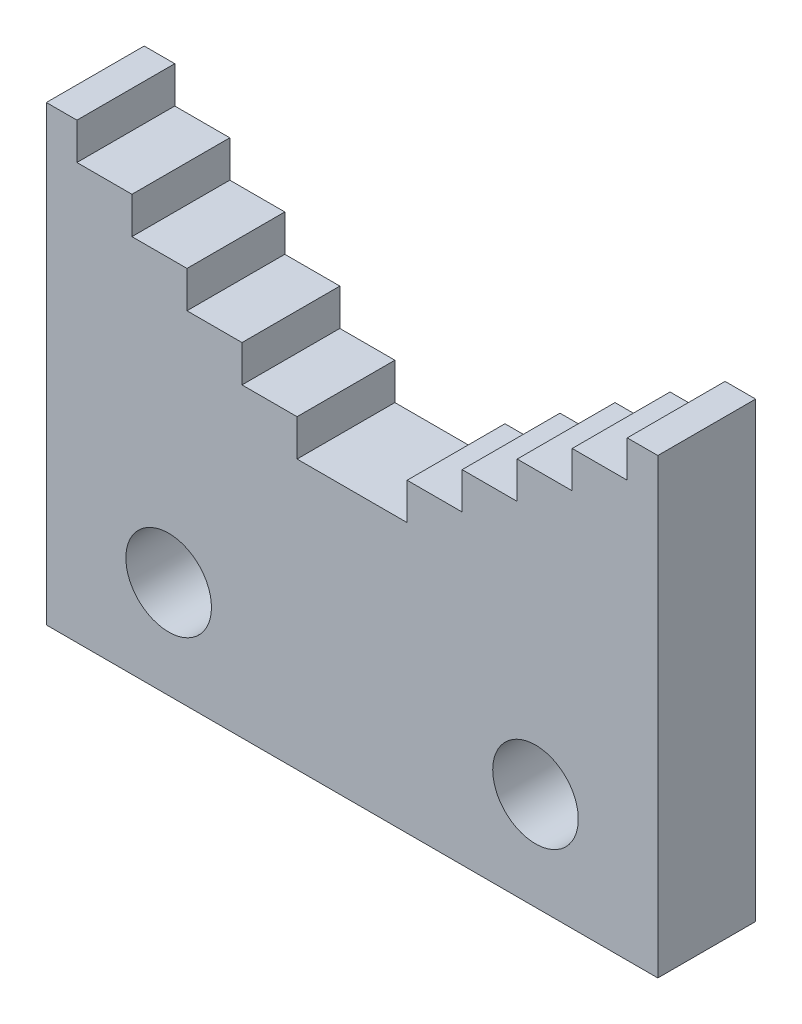
ISO-10303-21;
HEADER;
FILE_DESCRIPTION(('STEP AP214'),'2;1');
FILE_NAME('part.step','',(''),(''),'','','');
FILE_SCHEMA(('AUTOMOTIVE_DESIGN { 1 0 10303 214 1 1 1 1 }'));
ENDSEC;
DATA;
#1=APPLICATION_CONTEXT('core data for automotive mechanical design processes');
#2=APPLICATION_PROTOCOL_DEFINITION('international standard','automotive_design',2000,#1);
#3=PRODUCT_CONTEXT('',#1,'mechanical');
#4=PRODUCT('Part','Part','',(#3));
#5=PRODUCT_RELATED_PRODUCT_CATEGORY('part','',(#4));
#6=PRODUCT_DEFINITION_FORMATION('','',#4);
#7=PRODUCT_DEFINITION_CONTEXT('part definition',#1,'design');
#8=PRODUCT_DEFINITION('design','',#6,#7);
#9=PRODUCT_DEFINITION_SHAPE('','',#8);
#10=(LENGTH_UNIT() NAMED_UNIT(*) SI_UNIT(.MILLI.,.METRE.));
#11=(NAMED_UNIT(*) PLANE_ANGLE_UNIT() SI_UNIT($,.RADIAN.));
#12=(NAMED_UNIT(*) SI_UNIT($,.STERADIAN.) SOLID_ANGLE_UNIT());
#13=UNCERTAINTY_MEASURE_WITH_UNIT(LENGTH_MEASURE(1.E-05),#10,'distance_accuracy_value','');
#14=(GEOMETRIC_REPRESENTATION_CONTEXT(3) GLOBAL_UNCERTAINTY_ASSIGNED_CONTEXT((#13)) GLOBAL_UNIT_ASSIGNED_CONTEXT((#10,
#11,#12)) REPRESENTATION_CONTEXT('',''));
#15=CARTESIAN_POINT('',(0.,0.,0.));
#16=DIRECTION('',(0.,0.,1.));
#17=DIRECTION('',(1.,0.,0.));
#18=AXIS2_PLACEMENT_3D('',#15,#16,#17);
#19=CARTESIAN_POINT('',(0.,0.,8.));
#20=DIRECTION('',(0.,0.,-1.));
#21=DIRECTION('',(-1.,0.,0.));
#22=AXIS2_PLACEMENT_3D('',#19,#20,#21);
#23=PLANE('',#22);
#24=DIRECTION('',(0.,-1.,0.));
#25=VECTOR('',#24,1.);
#26=CARTESIAN_POINT('',(-25.,0.,8.));
#27=LINE('',#26,#25);
#28=CARTESIAN_POINT('',(-25.,37.,8.));
#29=VERTEX_POINT('',#28);
#30=CARTESIAN_POINT('',(-25.,0.,8.));
#31=VERTEX_POINT('',#30);
#32=EDGE_CURVE('E311',#29,#31,#27,.T.);
#33=ORIENTED_EDGE('',*,*,#32,.T.);
#34=DIRECTION('',(1.,0.,0.));
#35=VECTOR('',#34,1.);
#36=CARTESIAN_POINT('',(25.,0.,8.));
#37=LINE('',#36,#35);
#38=CARTESIAN_POINT('',(25.,0.,8.));
#39=VERTEX_POINT('',#38);
#40=EDGE_CURVE('E151',#31,#39,#37,.T.);
#41=ORIENTED_EDGE('',*,*,#40,.T.);
#42=DIRECTION('',(0.,1.,0.));
#43=VECTOR('',#42,1.);
#44=CARTESIAN_POINT('',(25.,0.,8.));
#45=LINE('',#44,#43);
#46=CARTESIAN_POINT('',(25.0000000000001,37.,8.));
#47=VERTEX_POINT('',#46);
#48=EDGE_CURVE('E396',#39,#47,#45,.T.);
#49=ORIENTED_EDGE('',*,*,#48,.T.);
#50=DIRECTION('',(-1.,0.,0.));
#51=VECTOR('',#50,1.);
#52=CARTESIAN_POINT('',(25.0000000000001,37.,8.));
#53=LINE('',#52,#51);
#54=CARTESIAN_POINT('',(22.5000000000001,37.,8.));
#55=VERTEX_POINT('',#54);
#56=EDGE_CURVE('E416',#47,#55,#53,.T.);
#57=ORIENTED_EDGE('',*,*,#56,.T.);
#58=DIRECTION('',(0.,-1.,0.));
#59=VECTOR('',#58,1.);
#60=CARTESIAN_POINT('',(22.5000000000001,37.,8.));
#61=LINE('',#60,#59);
#62=CARTESIAN_POINT('',(22.5,34.,8.));
#63=VERTEX_POINT('',#62);
#64=EDGE_CURVE('E412',#55,#63,#61,.T.);
#65=ORIENTED_EDGE('',*,*,#64,.T.);
#66=DIRECTION('',(-1.,0.,0.));
#67=VECTOR('',#66,1.);
#68=CARTESIAN_POINT('',(22.5,34.,8.));
#69=LINE('',#68,#67);
#70=CARTESIAN_POINT('',(18.,34.,8.));
#71=VERTEX_POINT('',#70);
#72=EDGE_CURVE('E415',#63,#71,#69,.T.);
#73=ORIENTED_EDGE('',*,*,#72,.T.);
#74=DIRECTION('',(0.,-1.,0.));
#75=VECTOR('',#74,1.);
#76=CARTESIAN_POINT('',(18.,34.,8.));
#77=LINE('',#76,#75);
#78=CARTESIAN_POINT('',(18.,31.,8.));
#79=VERTEX_POINT('',#78);
#80=EDGE_CURVE('E420',#71,#79,#77,.T.);
#81=ORIENTED_EDGE('',*,*,#80,.T.);
#82=DIRECTION('',(-1.,0.,0.));
#83=VECTOR('',#82,1.);
#84=CARTESIAN_POINT('',(18.,31.,8.));
#85=LINE('',#84,#83);
#86=CARTESIAN_POINT('',(13.5,31.,8.));
#87=VERTEX_POINT('',#86);
#88=EDGE_CURVE('E427',#79,#87,#85,.T.);
#89=ORIENTED_EDGE('',*,*,#88,.T.);
#90=DIRECTION('',(0.,-1.,0.));
#91=VECTOR('',#90,1.);
#92=CARTESIAN_POINT('',(13.5,31.,8.));
#93=LINE('',#92,#91);
#94=CARTESIAN_POINT('',(13.5,28.,8.));
#95=VERTEX_POINT('',#94);
#96=EDGE_CURVE('E430',#87,#95,#93,.T.);
#97=ORIENTED_EDGE('',*,*,#96,.T.);
#98=DIRECTION('',(-1.,0.,0.));
#99=VECTOR('',#98,1.);
#100=CARTESIAN_POINT('',(13.5,28.,8.));
#101=LINE('',#100,#99);
#102=CARTESIAN_POINT('',(9.00000000000004,28.,8.));
#103=VERTEX_POINT('',#102);
#104=EDGE_CURVE('E433',#95,#103,#101,.T.);
#105=ORIENTED_EDGE('',*,*,#104,.T.);
#106=DIRECTION('',(0.,-1.,0.));
#107=VECTOR('',#106,1.);
#108=CARTESIAN_POINT('',(9.00000000000004,28.,8.));
#109=LINE('',#108,#107);
#110=CARTESIAN_POINT('',(9.00000000000004,25.,8.));
#111=VERTEX_POINT('',#110);
#112=EDGE_CURVE('E436',#103,#111,#109,.T.);
#113=ORIENTED_EDGE('',*,*,#112,.T.);
#114=DIRECTION('',(-1.,0.,0.));
#115=VECTOR('',#114,1.);
#116=CARTESIAN_POINT('',(9.00000000000004,25.,8.));
#117=LINE('',#116,#115);
#118=CARTESIAN_POINT('',(4.50000000000004,25.,8.));
#119=VERTEX_POINT('',#118);
#120=EDGE_CURVE('E439',#111,#119,#117,.T.);
#121=ORIENTED_EDGE('',*,*,#120,.T.);
#122=DIRECTION('',(0.,-1.,0.));
#123=VECTOR('',#122,1.);
#124=CARTESIAN_POINT('',(4.50000000000004,25.,8.));
#125=LINE('',#124,#123);
#126=CARTESIAN_POINT('',(4.50000000000003,22.,8.));
#127=VERTEX_POINT('',#126);
#128=EDGE_CURVE('E442',#119,#127,#125,.T.);
#129=ORIENTED_EDGE('',*,*,#128,.T.);
#130=DIRECTION('',(-1.,0.,0.));
#131=VECTOR('',#130,1.);
#132=CARTESIAN_POINT('',(-4.50000000000001,22.,8.));
#133=LINE('',#132,#131);
#134=CARTESIAN_POINT('',(-4.50000000000001,22.,8.));
#135=VERTEX_POINT('',#134);
#136=EDGE_CURVE('E445',#127,#135,#133,.T.);
#137=ORIENTED_EDGE('',*,*,#136,.T.);
#138=DIRECTION('',(0.,1.,0.));
#139=VECTOR('',#138,1.);
#140=CARTESIAN_POINT('',(-4.50000000000001,25.,8.));
#141=LINE('',#140,#139);
#142=CARTESIAN_POINT('',(-4.50000000000001,25.,8.));
#143=VERTEX_POINT('',#142);
#144=EDGE_CURVE('E448',#135,#143,#141,.T.);
#145=ORIENTED_EDGE('',*,*,#144,.T.);
#146=DIRECTION('',(-1.,0.,0.));
#147=VECTOR('',#146,1.);
#148=CARTESIAN_POINT('',(-9.00000000000001,25.,8.));
#149=LINE('',#148,#147);
#150=CARTESIAN_POINT('',(-9.00000000000001,25.,8.));
#151=VERTEX_POINT('',#150);
#152=EDGE_CURVE('E451',#143,#151,#149,.T.);
#153=ORIENTED_EDGE('',*,*,#152,.T.);
#154=DIRECTION('',(0.,1.,0.));
#155=VECTOR('',#154,1.);
#156=CARTESIAN_POINT('',(-9.00000000000001,28.,8.));
#157=LINE('',#156,#155);
#158=CARTESIAN_POINT('',(-9.00000000000001,28.,8.));
#159=VERTEX_POINT('',#158);
#160=EDGE_CURVE('E454',#151,#159,#157,.T.);
#161=ORIENTED_EDGE('',*,*,#160,.T.);
#162=DIRECTION('',(-1.,0.,0.));
#163=VECTOR('',#162,1.);
#164=CARTESIAN_POINT('',(-13.5,28.,8.));
#165=LINE('',#164,#163);
#166=CARTESIAN_POINT('',(-13.5,28.,8.));
#167=VERTEX_POINT('',#166);
#168=EDGE_CURVE('E457',#159,#167,#165,.T.);
#169=ORIENTED_EDGE('',*,*,#168,.T.);
#170=DIRECTION('',(0.,1.,0.));
#171=VECTOR('',#170,1.);
#172=CARTESIAN_POINT('',(-13.5,31.,8.));
#173=LINE('',#172,#171);
#174=CARTESIAN_POINT('',(-13.5,31.,8.));
#175=VERTEX_POINT('',#174);
#176=EDGE_CURVE('E460',#167,#175,#173,.T.);
#177=ORIENTED_EDGE('',*,*,#176,.T.);
#178=DIRECTION('',(-1.,0.,0.));
#179=VECTOR('',#178,1.);
#180=CARTESIAN_POINT('',(-18.,31.,8.));
#181=LINE('',#180,#179);
#182=CARTESIAN_POINT('',(-18.,31.,8.));
#183=VERTEX_POINT('',#182);
#184=EDGE_CURVE('E463',#175,#183,#181,.T.);
#185=ORIENTED_EDGE('',*,*,#184,.T.);
#186=DIRECTION('',(0.,1.,0.));
#187=VECTOR('',#186,1.);
#188=CARTESIAN_POINT('',(-18.,34.,8.));
#189=LINE('',#188,#187);
#190=CARTESIAN_POINT('',(-18.,34.,8.));
#191=VERTEX_POINT('',#190);
#192=EDGE_CURVE('E218',#183,#191,#189,.T.);
#193=ORIENTED_EDGE('',*,*,#192,.T.);
#194=DIRECTION('',(-1.,0.,0.));
#195=VECTOR('',#194,1.);
#196=CARTESIAN_POINT('',(-22.5,34.,8.));
#197=LINE('',#196,#195);
#198=CARTESIAN_POINT('',(-22.5,34.,8.));
#199=VERTEX_POINT('',#198);
#200=EDGE_CURVE('E212',#191,#199,#197,.T.);
#201=ORIENTED_EDGE('',*,*,#200,.T.);
#202=DIRECTION('',(0.,1.,0.));
#203=VECTOR('',#202,1.);
#204=CARTESIAN_POINT('',(-22.5,37.,8.));
#205=LINE('',#204,#203);
#206=CARTESIAN_POINT('',(-22.5,37.,8.));
#207=VERTEX_POINT('',#206);
#208=EDGE_CURVE('E216',#199,#207,#205,.T.);
#209=ORIENTED_EDGE('',*,*,#208,.T.);
#210=DIRECTION('',(-1.,0.,0.));
#211=VECTOR('',#210,1.);
#212=CARTESIAN_POINT('',(-25.,37.,8.));
#213=LINE('',#212,#211);
#214=EDGE_CURVE('E60',#207,#29,#213,.T.);
#215=ORIENTED_EDGE('',*,*,#214,.T.);
#216=EDGE_LOOP('',(#33,#41,#49,#57,#65,#73,#81,#89,#97,#105,#113,#121,#129,#137,#145,#153,#161,
#169,#177,#185,#193,#201,#209,#215));
#217=FACE_BOUND('',#216,.T.);
#218=CARTESIAN_POINT('',(-15.,8.,8.));
#219=DIRECTION('',(0.,0.,1.));
#220=DIRECTION('',(1.,0.,0.));
#221=AXIS2_PLACEMENT_3D('',#218,#219,#220);
#222=CIRCLE('',#221,3.5);
#223=CARTESIAN_POINT('',(-11.5,8.,8.));
#224=VERTEX_POINT('',#223);
#225=EDGE_CURVE('E245',#224,#224,#222,.T.);
#226=ORIENTED_EDGE('',*,*,#225,.F.);
#227=EDGE_LOOP('',(#226));
#228=FACE_BOUND('',#227,.T.);
#229=CARTESIAN_POINT('',(15.,7.99999999999998,8.));
#230=DIRECTION('',(0.,0.,1.));
#231=DIRECTION('',(-1.,0.,0.));
#232=AXIS2_PLACEMENT_3D('',#229,#230,#231);
#233=CIRCLE('',#232,3.5);
#234=CARTESIAN_POINT('',(11.5,7.99999999999998,8.));
#235=VERTEX_POINT('',#234);
#236=EDGE_CURVE('E506',#235,#235,#233,.T.);
#237=ORIENTED_EDGE('',*,*,#236,.F.);
#238=EDGE_LOOP('',(#237));
#239=FACE_BOUND('',#238,.T.);
#240=ADVANCED_FACE('F42',(#217,#228,#239),#23,.F.);
#241=CARTESIAN_POINT('',(0.,0.,0.));
#242=DIRECTION('',(0.,0.,-1.));
#243=DIRECTION('',(-1.,0.,0.));
#244=AXIS2_PLACEMENT_3D('',#241,#242,#243);
#245=PLANE('',#244);
#246=CARTESIAN_POINT('',(-15.,8.,0.));
#247=DIRECTION('',(0.,0.,1.));
#248=DIRECTION('',(1.,0.,0.));
#249=AXIS2_PLACEMENT_3D('',#246,#247,#248);
#250=CIRCLE('',#249,3.5);
#251=CARTESIAN_POINT('',(-11.5,8.,0.));
#252=VERTEX_POINT('',#251);
#253=EDGE_CURVE('E513',#252,#252,#250,.T.);
#254=ORIENTED_EDGE('',*,*,#253,.T.);
#255=EDGE_LOOP('',(#254));
#256=FACE_BOUND('',#255,.T.);
#257=DIRECTION('',(0.,-1.,0.));
#258=VECTOR('',#257,1.);
#259=CARTESIAN_POINT('',(-25.,0.,0.));
#260=LINE('',#259,#258);
#261=CARTESIAN_POINT('',(-25.,37.,0.));
#262=VERTEX_POINT('',#261);
#263=CARTESIAN_POINT('',(-25.,0.,0.));
#264=VERTEX_POINT('',#263);
#265=EDGE_CURVE('E240',#262,#264,#260,.T.);
#266=ORIENTED_EDGE('',*,*,#265,.F.);
#267=DIRECTION('',(-1.,0.,0.));
#268=VECTOR('',#267,1.);
#269=CARTESIAN_POINT('',(-25.,37.,0.));
#270=LINE('',#269,#268);
#271=CARTESIAN_POINT('',(-22.5,37.,0.));
#272=VERTEX_POINT('',#271);
#273=EDGE_CURVE('E143',#272,#262,#270,.T.);
#274=ORIENTED_EDGE('',*,*,#273,.F.);
#275=DIRECTION('',(0.,1.,0.));
#276=VECTOR('',#275,1.);
#277=CARTESIAN_POINT('',(-22.5,37.,0.));
#278=LINE('',#277,#276);
#279=CARTESIAN_POINT('',(-22.5,34.,0.));
#280=VERTEX_POINT('',#279);
#281=EDGE_CURVE('E137',#280,#272,#278,.T.);
#282=ORIENTED_EDGE('',*,*,#281,.F.);
#283=DIRECTION('',(-1.,0.,0.));
#284=VECTOR('',#283,1.);
#285=CARTESIAN_POINT('',(-22.5,34.,0.));
#286=LINE('',#285,#284);
#287=CARTESIAN_POINT('',(-18.,34.,0.));
#288=VERTEX_POINT('',#287);
#289=EDGE_CURVE('E227',#288,#280,#286,.T.);
#290=ORIENTED_EDGE('',*,*,#289,.F.);
#291=DIRECTION('',(0.,1.,0.));
#292=VECTOR('',#291,1.);
#293=CARTESIAN_POINT('',(-18.,34.,0.));
#294=LINE('',#293,#292);
#295=CARTESIAN_POINT('',(-18.,31.,0.));
#296=VERTEX_POINT('',#295);
#297=EDGE_CURVE('E302',#296,#288,#294,.T.);
#298=ORIENTED_EDGE('',*,*,#297,.F.);
#299=DIRECTION('',(-1.,0.,0.));
#300=VECTOR('',#299,1.);
#301=CARTESIAN_POINT('',(-18.,31.,0.));
#302=LINE('',#301,#300);
#303=CARTESIAN_POINT('',(-13.5,31.,0.));
#304=VERTEX_POINT('',#303);
#305=EDGE_CURVE('E299',#304,#296,#302,.T.);
#306=ORIENTED_EDGE('',*,*,#305,.F.);
#307=DIRECTION('',(0.,1.,0.));
#308=VECTOR('',#307,1.);
#309=CARTESIAN_POINT('',(-13.5,31.,0.));
#310=LINE('',#309,#308);
#311=CARTESIAN_POINT('',(-13.5,28.,0.));
#312=VERTEX_POINT('',#311);
#313=EDGE_CURVE('E296',#312,#304,#310,.T.);
#314=ORIENTED_EDGE('',*,*,#313,.F.);
#315=DIRECTION('',(-1.,0.,0.));
#316=VECTOR('',#315,1.);
#317=CARTESIAN_POINT('',(-13.5,28.,0.));
#318=LINE('',#317,#316);
#319=CARTESIAN_POINT('',(-9.00000000000001,28.,0.));
#320=VERTEX_POINT('',#319);
#321=EDGE_CURVE('E293',#320,#312,#318,.T.);
#322=ORIENTED_EDGE('',*,*,#321,.F.);
#323=DIRECTION('',(0.,1.,0.));
#324=VECTOR('',#323,1.);
#325=CARTESIAN_POINT('',(-9.00000000000001,28.,0.));
#326=LINE('',#325,#324);
#327=CARTESIAN_POINT('',(-9.00000000000001,25.,0.));
#328=VERTEX_POINT('',#327);
#329=EDGE_CURVE('E290',#328,#320,#326,.T.);
#330=ORIENTED_EDGE('',*,*,#329,.F.);
#331=DIRECTION('',(-1.,0.,0.));
#332=VECTOR('',#331,1.);
#333=CARTESIAN_POINT('',(-9.00000000000001,25.,0.));
#334=LINE('',#333,#332);
#335=CARTESIAN_POINT('',(-4.50000000000001,25.,0.));
#336=VERTEX_POINT('',#335);
#337=EDGE_CURVE('E287',#336,#328,#334,.T.);
#338=ORIENTED_EDGE('',*,*,#337,.F.);
#339=DIRECTION('',(0.,1.,0.));
#340=VECTOR('',#339,1.);
#341=CARTESIAN_POINT('',(-4.50000000000001,25.,0.));
#342=LINE('',#341,#340);
#343=CARTESIAN_POINT('',(-4.50000000000001,22.,0.));
#344=VERTEX_POINT('',#343);
#345=EDGE_CURVE('E284',#344,#336,#342,.T.);
#346=ORIENTED_EDGE('',*,*,#345,.F.);
#347=DIRECTION('',(-1.,0.,0.));
#348=VECTOR('',#347,1.);
#349=CARTESIAN_POINT('',(-4.50000000000001,22.,0.));
#350=LINE('',#349,#348);
#351=CARTESIAN_POINT('',(4.50000000000003,22.,0.));
#352=VERTEX_POINT('',#351);
#353=EDGE_CURVE('E281',#352,#344,#350,.T.);
#354=ORIENTED_EDGE('',*,*,#353,.F.);
#355=DIRECTION('',(0.,-1.,0.));
#356=VECTOR('',#355,1.);
#357=CARTESIAN_POINT('',(4.50000000000004,25.,0.));
#358=LINE('',#357,#356);
#359=CARTESIAN_POINT('',(4.50000000000004,25.,0.));
#360=VERTEX_POINT('',#359);
#361=EDGE_CURVE('E278',#360,#352,#358,.T.);
#362=ORIENTED_EDGE('',*,*,#361,.F.);
#363=DIRECTION('',(-1.,0.,0.));
#364=VECTOR('',#363,1.);
#365=CARTESIAN_POINT('',(9.00000000000004,25.,0.));
#366=LINE('',#365,#364);
#367=CARTESIAN_POINT('',(9.00000000000004,25.,0.));
#368=VERTEX_POINT('',#367);
#369=EDGE_CURVE('E275',#368,#360,#366,.T.);
#370=ORIENTED_EDGE('',*,*,#369,.F.);
#371=DIRECTION('',(0.,-1.,0.));
#372=VECTOR('',#371,1.);
#373=CARTESIAN_POINT('',(9.00000000000004,28.,0.));
#374=LINE('',#373,#372);
#375=CARTESIAN_POINT('',(9.00000000000004,28.,0.));
#376=VERTEX_POINT('',#375);
#377=EDGE_CURVE('E272',#376,#368,#374,.T.);
#378=ORIENTED_EDGE('',*,*,#377,.F.);
#379=DIRECTION('',(-1.,0.,0.));
#380=VECTOR('',#379,1.);
#381=CARTESIAN_POINT('',(13.5,28.,0.));
#382=LINE('',#381,#380);
#383=CARTESIAN_POINT('',(13.5,28.,0.));
#384=VERTEX_POINT('',#383);
#385=EDGE_CURVE('E269',#384,#376,#382,.T.);
#386=ORIENTED_EDGE('',*,*,#385,.F.);
#387=DIRECTION('',(0.,-1.,0.));
#388=VECTOR('',#387,1.);
#389=CARTESIAN_POINT('',(13.5,31.,0.));
#390=LINE('',#389,#388);
#391=CARTESIAN_POINT('',(13.5,31.,0.));
#392=VERTEX_POINT('',#391);
#393=EDGE_CURVE('E266',#392,#384,#390,.T.);
#394=ORIENTED_EDGE('',*,*,#393,.F.);
#395=DIRECTION('',(-1.,0.,0.));
#396=VECTOR('',#395,1.);
#397=CARTESIAN_POINT('',(18.,31.,0.));
#398=LINE('',#397,#396);
#399=CARTESIAN_POINT('',(18.,31.,0.));
#400=VERTEX_POINT('',#399);
#401=EDGE_CURVE('E263',#400,#392,#398,.T.);
#402=ORIENTED_EDGE('',*,*,#401,.F.);
#403=DIRECTION('',(0.,-1.,0.));
#404=VECTOR('',#403,1.);
#405=CARTESIAN_POINT('',(18.,34.,0.));
#406=LINE('',#405,#404);
#407=CARTESIAN_POINT('',(18.,34.,0.));
#408=VERTEX_POINT('',#407);
#409=EDGE_CURVE('E260',#408,#400,#406,.T.);
#410=ORIENTED_EDGE('',*,*,#409,.F.);
#411=DIRECTION('',(-1.,0.,0.));
#412=VECTOR('',#411,1.);
#413=CARTESIAN_POINT('',(22.5,34.,0.));
#414=LINE('',#413,#412);
#415=CARTESIAN_POINT('',(22.5,34.,0.));
#416=VERTEX_POINT('',#415);
#417=EDGE_CURVE('E257',#416,#408,#414,.T.);
#418=ORIENTED_EDGE('',*,*,#417,.F.);
#419=DIRECTION('',(0.,-1.,0.));
#420=VECTOR('',#419,1.);
#421=CARTESIAN_POINT('',(22.5000000000001,37.,0.));
#422=LINE('',#421,#420);
#423=CARTESIAN_POINT('',(22.5000000000001,37.,0.));
#424=VERTEX_POINT('',#423);
#425=EDGE_CURVE('E254',#424,#416,#422,.T.);
#426=ORIENTED_EDGE('',*,*,#425,.F.);
#427=DIRECTION('',(-1.,0.,0.));
#428=VECTOR('',#427,1.);
#429=CARTESIAN_POINT('',(25.0000000000001,37.,0.));
#430=LINE('',#429,#428);
#431=CARTESIAN_POINT('',(25.0000000000001,37.,0.));
#432=VERTEX_POINT('',#431);
#433=EDGE_CURVE('E251',#432,#424,#430,.T.);
#434=ORIENTED_EDGE('',*,*,#433,.F.);
#435=DIRECTION('',(0.,1.,0.));
#436=VECTOR('',#435,1.);
#437=CARTESIAN_POINT('',(25.,0.,0.));
#438=LINE('',#437,#436);
#439=CARTESIAN_POINT('',(25.,0.,0.));
#440=VERTEX_POINT('',#439);
#441=EDGE_CURVE('E248',#440,#432,#438,.T.);
#442=ORIENTED_EDGE('',*,*,#441,.F.);
#443=DIRECTION('',(1.,0.,0.));
#444=VECTOR('',#443,1.);
#445=CARTESIAN_POINT('',(25.,0.,0.));
#446=LINE('',#445,#444);
#447=EDGE_CURVE('E244',#264,#440,#446,.T.);
#448=ORIENTED_EDGE('',*,*,#447,.F.);
#449=EDGE_LOOP('',(#266,#274,#282,#290,#298,#306,#314,#322,#330,#338,#346,#354,#362,#370,#378,
#386,#394,#402,#410,#418,#426,#434,#442,#448));
#450=FACE_BOUND('',#449,.T.);
#451=CARTESIAN_POINT('',(15.,7.99999999999998,0.));
#452=DIRECTION('',(0.,0.,1.));
#453=DIRECTION('',(-1.,0.,0.));
#454=AXIS2_PLACEMENT_3D('',#451,#452,#453);
#455=CIRCLE('',#454,3.5);
#456=CARTESIAN_POINT('',(11.5,7.99999999999998,0.));
#457=VERTEX_POINT('',#456);
#458=EDGE_CURVE('E509',#457,#457,#455,.T.);
#459=ORIENTED_EDGE('',*,*,#458,.T.);
#460=EDGE_LOOP('',(#459));
#461=FACE_BOUND('',#460,.T.);
#462=ADVANCED_FACE('F400',(#256,#450,#461),#245,.T.);
#463=CARTESIAN_POINT('',(-25.,0.,8.));
#464=DIRECTION('',(1.,0.,0.));
#465=DIRECTION('',(0.,1.,0.));
#466=AXIS2_PLACEMENT_3D('',#463,#464,#465);
#467=PLANE('',#466);
#468=ORIENTED_EDGE('',*,*,#265,.T.);
#469=DIRECTION('',(0.,0.,-1.));
#470=VECTOR('',#469,1.);
#471=CARTESIAN_POINT('',(-25.,0.,8.));
#472=LINE('',#471,#470);
#473=EDGE_CURVE('E11',#31,#264,#472,.T.);
#474=ORIENTED_EDGE('',*,*,#473,.F.);
#475=ORIENTED_EDGE('',*,*,#32,.F.);
#476=DIRECTION('',(0.,0.,-1.));
#477=VECTOR('',#476,1.);
#478=CARTESIAN_POINT('',(-25.,37.,8.));
#479=LINE('',#478,#477);
#480=EDGE_CURVE('E236',#29,#262,#479,.T.);
#481=ORIENTED_EDGE('',*,*,#480,.T.);
#482=EDGE_LOOP('',(#468,#474,#475,#481));
#483=FACE_BOUND('',#482,.T.);
#484=ADVANCED_FACE('F44',(#483),#467,.F.);
#485=CARTESIAN_POINT('',(25.,0.,8.));
#486=DIRECTION('',(0.,1.,0.));
#487=DIRECTION('',(-1.,0.,0.));
#488=AXIS2_PLACEMENT_3D('',#485,#486,#487);
#489=PLANE('',#488);
#490=ORIENTED_EDGE('',*,*,#447,.T.);
#491=DIRECTION('',(0.,0.,-1.));
#492=VECTOR('',#491,1.);
#493=CARTESIAN_POINT('',(25.,0.,8.));
#494=LINE('',#493,#492);
#495=EDGE_CURVE('E52',#39,#440,#494,.T.);
#496=ORIENTED_EDGE('',*,*,#495,.F.);
#497=ORIENTED_EDGE('',*,*,#40,.F.);
#498=ORIENTED_EDGE('',*,*,#473,.T.);
#499=EDGE_LOOP('',(#490,#496,#497,#498));
#500=FACE_BOUND('',#499,.T.);
#501=ADVANCED_FACE('F755',(#500),#489,.F.);
#502=CARTESIAN_POINT('',(25.,0.,8.));
#503=DIRECTION('',(-1.,0.,0.));
#504=DIRECTION('',(0.,-1.,0.));
#505=AXIS2_PLACEMENT_3D('',#502,#503,#504);
#506=PLANE('',#505);
#507=ORIENTED_EDGE('',*,*,#441,.T.);
#508=DIRECTION('',(0.,0.,-1.));
#509=VECTOR('',#508,1.);
#510=CARTESIAN_POINT('',(25.0000000000001,37.,8.));
#511=LINE('',#510,#509);
#512=EDGE_CURVE('E386',#47,#432,#511,.T.);
#513=ORIENTED_EDGE('',*,*,#512,.F.);
#514=ORIENTED_EDGE('',*,*,#48,.F.);
#515=ORIENTED_EDGE('',*,*,#495,.T.);
#516=EDGE_LOOP('',(#507,#513,#514,#515));
#517=FACE_BOUND('',#516,.T.);
#518=ADVANCED_FACE('F394',(#517),#506,.F.);
#519=CARTESIAN_POINT('',(25.0000000000001,37.,8.));
#520=DIRECTION('',(0.,-1.,0.));
#521=DIRECTION('',(0.,0.,-1.));
#522=AXIS2_PLACEMENT_3D('',#519,#520,#521);
#523=PLANE('',#522);
#524=ORIENTED_EDGE('',*,*,#433,.T.);
#525=DIRECTION('',(0.,0.,-1.));
#526=VECTOR('',#525,1.);
#527=CARTESIAN_POINT('',(22.5000000000001,37.,8.));
#528=LINE('',#527,#526);
#529=EDGE_CURVE('E382',#55,#424,#528,.T.);
#530=ORIENTED_EDGE('',*,*,#529,.F.);
#531=ORIENTED_EDGE('',*,*,#56,.F.);
#532=ORIENTED_EDGE('',*,*,#512,.T.);
#533=EDGE_LOOP('',(#524,#530,#531,#532));
#534=FACE_BOUND('',#533,.T.);
#535=ADVANCED_FACE('F406',(#534),#523,.F.);
#536=CARTESIAN_POINT('',(22.5000000000001,37.,8.));
#537=DIRECTION('',(1.,0.,0.));
#538=DIRECTION('',(0.,1.,0.));
#539=AXIS2_PLACEMENT_3D('',#536,#537,#538);
#540=PLANE('',#539);
#541=ORIENTED_EDGE('',*,*,#425,.T.);
#542=DIRECTION('',(0.,0.,-1.));
#543=VECTOR('',#542,1.);
#544=CARTESIAN_POINT('',(22.5,34.,8.));
#545=LINE('',#544,#543);
#546=EDGE_CURVE('E378',#63,#416,#545,.T.);
#547=ORIENTED_EDGE('',*,*,#546,.F.);
#548=ORIENTED_EDGE('',*,*,#64,.F.);
#549=ORIENTED_EDGE('',*,*,#529,.T.);
#550=EDGE_LOOP('',(#541,#547,#548,#549));
#551=FACE_BOUND('',#550,.T.);
#552=ADVANCED_FACE('F410',(#551),#540,.F.);
#553=CARTESIAN_POINT('',(22.5,34.,8.));
#554=DIRECTION('',(0.,-1.,0.));
#555=DIRECTION('',(0.,0.,-1.));
#556=AXIS2_PLACEMENT_3D('',#553,#554,#555);
#557=PLANE('',#556);
#558=ORIENTED_EDGE('',*,*,#417,.T.);
#559=DIRECTION('',(0.,0.,-1.));
#560=VECTOR('',#559,1.);
#561=CARTESIAN_POINT('',(18.,34.,8.));
#562=LINE('',#561,#560);
#563=EDGE_CURVE('E374',#71,#408,#562,.T.);
#564=ORIENTED_EDGE('',*,*,#563,.F.);
#565=ORIENTED_EDGE('',*,*,#72,.F.);
#566=ORIENTED_EDGE('',*,*,#546,.T.);
#567=EDGE_LOOP('',(#558,#564,#565,#566));
#568=FACE_BOUND('',#567,.T.);
#569=ADVANCED_FACE('F716',(#568),#557,.F.);
#570=CARTESIAN_POINT('',(18.,34.,8.));
#571=DIRECTION('',(1.,0.,0.));
#572=DIRECTION('',(0.,0.,-1.));
#573=AXIS2_PLACEMENT_3D('',#570,#571,#572);
#574=PLANE('',#573);
#575=ORIENTED_EDGE('',*,*,#409,.T.);
#576=DIRECTION('',(0.,0.,-1.));
#577=VECTOR('',#576,1.);
#578=CARTESIAN_POINT('',(18.,31.,8.));
#579=LINE('',#578,#577);
#580=EDGE_CURVE('E370',#79,#400,#579,.T.);
#581=ORIENTED_EDGE('',*,*,#580,.F.);
#582=ORIENTED_EDGE('',*,*,#80,.F.);
#583=ORIENTED_EDGE('',*,*,#563,.T.);
#584=EDGE_LOOP('',(#575,#581,#582,#583));
#585=FACE_BOUND('',#584,.T.);
#586=ADVANCED_FACE('F705',(#585),#574,.F.);
#587=CARTESIAN_POINT('',(18.,31.,8.));
#588=DIRECTION('',(0.,-1.,0.));
#589=DIRECTION('',(1.,0.,0.));
#590=AXIS2_PLACEMENT_3D('',#587,#588,#589);
#591=PLANE('',#590);
#592=ORIENTED_EDGE('',*,*,#401,.T.);
#593=DIRECTION('',(0.,0.,-1.));
#594=VECTOR('',#593,1.);
#595=CARTESIAN_POINT('',(13.5,31.,8.));
#596=LINE('',#595,#594);
#597=EDGE_CURVE('E366',#87,#392,#596,.T.);
#598=ORIENTED_EDGE('',*,*,#597,.F.);
#599=ORIENTED_EDGE('',*,*,#88,.F.);
#600=ORIENTED_EDGE('',*,*,#580,.T.);
#601=EDGE_LOOP('',(#592,#598,#599,#600));
#602=FACE_BOUND('',#601,.T.);
#603=ADVANCED_FACE('F694',(#602),#591,.F.);
#604=CARTESIAN_POINT('',(13.5,31.,8.));
#605=DIRECTION('',(1.,0.,0.));
#606=DIRECTION('',(0.,0.,-1.));
#607=AXIS2_PLACEMENT_3D('',#604,#605,#606);
#608=PLANE('',#607);
#609=ORIENTED_EDGE('',*,*,#393,.T.);
#610=DIRECTION('',(0.,0.,-1.));
#611=VECTOR('',#610,1.);
#612=CARTESIAN_POINT('',(13.5,28.,8.));
#613=LINE('',#612,#611);
#614=EDGE_CURVE('E362',#95,#384,#613,.T.);
#615=ORIENTED_EDGE('',*,*,#614,.F.);
#616=ORIENTED_EDGE('',*,*,#96,.F.);
#617=ORIENTED_EDGE('',*,*,#597,.T.);
#618=EDGE_LOOP('',(#609,#615,#616,#617));
#619=FACE_BOUND('',#618,.T.);
#620=ADVANCED_FACE('F683',(#619),#608,.F.);
#621=CARTESIAN_POINT('',(13.5,28.,8.));
#622=DIRECTION('',(0.,-1.,0.));
#623=DIRECTION('',(1.,0.,0.));
#624=AXIS2_PLACEMENT_3D('',#621,#622,#623);
#625=PLANE('',#624);
#626=ORIENTED_EDGE('',*,*,#385,.T.);
#627=DIRECTION('',(0.,0.,-1.));
#628=VECTOR('',#627,1.);
#629=CARTESIAN_POINT('',(9.00000000000004,28.,8.));
#630=LINE('',#629,#628);
#631=EDGE_CURVE('E358',#103,#376,#630,.T.);
#632=ORIENTED_EDGE('',*,*,#631,.F.);
#633=ORIENTED_EDGE('',*,*,#104,.F.);
#634=ORIENTED_EDGE('',*,*,#614,.T.);
#635=EDGE_LOOP('',(#626,#632,#633,#634));
#636=FACE_BOUND('',#635,.T.);
#637=ADVANCED_FACE('F672',(#636),#625,.F.);
#638=CARTESIAN_POINT('',(9.00000000000004,28.,8.));
#639=DIRECTION('',(1.,0.,0.));
#640=DIRECTION('',(0.,0.,-1.));
#641=AXIS2_PLACEMENT_3D('',#638,#639,#640);
#642=PLANE('',#641);
#643=ORIENTED_EDGE('',*,*,#377,.T.);
#644=DIRECTION('',(0.,0.,-1.));
#645=VECTOR('',#644,1.);
#646=CARTESIAN_POINT('',(9.00000000000004,25.,8.));
#647=LINE('',#646,#645);
#648=EDGE_CURVE('E354',#111,#368,#647,.T.);
#649=ORIENTED_EDGE('',*,*,#648,.F.);
#650=ORIENTED_EDGE('',*,*,#112,.F.);
#651=ORIENTED_EDGE('',*,*,#631,.T.);
#652=EDGE_LOOP('',(#643,#649,#650,#651));
#653=FACE_BOUND('',#652,.T.);
#654=ADVANCED_FACE('F661',(#653),#642,.F.);
#655=CARTESIAN_POINT('',(9.00000000000004,25.,8.));
#656=DIRECTION('',(0.,-1.,0.));
#657=DIRECTION('',(1.,0.,0.));
#658=AXIS2_PLACEMENT_3D('',#655,#656,#657);
#659=PLANE('',#658);
#660=ORIENTED_EDGE('',*,*,#369,.T.);
#661=DIRECTION('',(0.,0.,-1.));
#662=VECTOR('',#661,1.);
#663=CARTESIAN_POINT('',(4.50000000000004,25.,8.));
#664=LINE('',#663,#662);
#665=EDGE_CURVE('E350',#119,#360,#664,.T.);
#666=ORIENTED_EDGE('',*,*,#665,.F.);
#667=ORIENTED_EDGE('',*,*,#120,.F.);
#668=ORIENTED_EDGE('',*,*,#648,.T.);
#669=EDGE_LOOP('',(#660,#666,#667,#668));
#670=FACE_BOUND('',#669,.T.);
#671=ADVANCED_FACE('F650',(#670),#659,.F.);
#672=CARTESIAN_POINT('',(4.50000000000004,25.,8.));
#673=DIRECTION('',(1.,0.,0.));
#674=DIRECTION('',(0.,1.,0.));
#675=AXIS2_PLACEMENT_3D('',#672,#673,#674);
#676=PLANE('',#675);
#677=ORIENTED_EDGE('',*,*,#361,.T.);
#678=DIRECTION('',(0.,0.,-1.));
#679=VECTOR('',#678,1.);
#680=CARTESIAN_POINT('',(4.50000000000003,22.,8.));
#681=LINE('',#680,#679);
#682=EDGE_CURVE('E346',#127,#352,#681,.T.);
#683=ORIENTED_EDGE('',*,*,#682,.F.);
#684=ORIENTED_EDGE('',*,*,#128,.F.);
#685=ORIENTED_EDGE('',*,*,#665,.T.);
#686=EDGE_LOOP('',(#677,#683,#684,#685));
#687=FACE_BOUND('',#686,.T.);
#688=ADVANCED_FACE('F639',(#687),#676,.F.);
#689=CARTESIAN_POINT('',(-4.50000000000001,22.,8.));
#690=DIRECTION('',(0.,-1.,0.));
#691=DIRECTION('',(1.,0.,0.));
#692=AXIS2_PLACEMENT_3D('',#689,#690,#691);
#693=PLANE('',#692);
#694=ORIENTED_EDGE('',*,*,#353,.T.);
#695=DIRECTION('',(0.,0.,-1.));
#696=VECTOR('',#695,1.);
#697=CARTESIAN_POINT('',(-4.50000000000001,22.,8.));
#698=LINE('',#697,#696);
#699=EDGE_CURVE('E342',#135,#344,#698,.T.);
#700=ORIENTED_EDGE('',*,*,#699,.F.);
#701=ORIENTED_EDGE('',*,*,#136,.F.);
#702=ORIENTED_EDGE('',*,*,#682,.T.);
#703=EDGE_LOOP('',(#694,#700,#701,#702));
#704=FACE_BOUND('',#703,.T.);
#705=ADVANCED_FACE('F628',(#704),#693,.F.);
#706=CARTESIAN_POINT('',(-4.50000000000001,25.,8.));
#707=DIRECTION('',(-1.,0.,0.));
#708=DIRECTION('',(0.,0.,1.));
#709=AXIS2_PLACEMENT_3D('',#706,#707,#708);
#710=PLANE('',#709);
#711=ORIENTED_EDGE('',*,*,#345,.T.);
#712=DIRECTION('',(0.,0.,-1.));
#713=VECTOR('',#712,1.);
#714=CARTESIAN_POINT('',(-4.50000000000001,25.,8.));
#715=LINE('',#714,#713);
#716=EDGE_CURVE('E338',#143,#336,#715,.T.);
#717=ORIENTED_EDGE('',*,*,#716,.F.);
#718=ORIENTED_EDGE('',*,*,#144,.F.);
#719=ORIENTED_EDGE('',*,*,#699,.T.);
#720=EDGE_LOOP('',(#711,#717,#718,#719));
#721=FACE_BOUND('',#720,.T.);
#722=ADVANCED_FACE('F617',(#721),#710,.F.);
#723=CARTESIAN_POINT('',(-9.00000000000001,25.,8.));
#724=DIRECTION('',(0.,-1.,0.));
#725=DIRECTION('',(0.,0.,-1.));
#726=AXIS2_PLACEMENT_3D('',#723,#724,#725);
#727=PLANE('',#726);
#728=ORIENTED_EDGE('',*,*,#337,.T.);
#729=DIRECTION('',(0.,0.,-1.));
#730=VECTOR('',#729,1.);
#731=CARTESIAN_POINT('',(-9.00000000000001,25.,8.));
#732=LINE('',#731,#730);
#733=EDGE_CURVE('E334',#151,#328,#732,.T.);
#734=ORIENTED_EDGE('',*,*,#733,.F.);
#735=ORIENTED_EDGE('',*,*,#152,.F.);
#736=ORIENTED_EDGE('',*,*,#716,.T.);
#737=EDGE_LOOP('',(#728,#734,#735,#736));
#738=FACE_BOUND('',#737,.T.);
#739=ADVANCED_FACE('F606',(#738),#727,.F.);
#740=CARTESIAN_POINT('',(-9.00000000000001,28.,8.));
#741=DIRECTION('',(-1.,0.,0.));
#742=DIRECTION('',(0.,-1.,0.));
#743=AXIS2_PLACEMENT_3D('',#740,#741,#742);
#744=PLANE('',#743);
#745=ORIENTED_EDGE('',*,*,#329,.T.);
#746=DIRECTION('',(0.,0.,-1.));
#747=VECTOR('',#746,1.);
#748=CARTESIAN_POINT('',(-9.00000000000001,28.,8.));
#749=LINE('',#748,#747);
#750=EDGE_CURVE('E330',#159,#320,#749,.T.);
#751=ORIENTED_EDGE('',*,*,#750,.F.);
#752=ORIENTED_EDGE('',*,*,#160,.F.);
#753=ORIENTED_EDGE('',*,*,#733,.T.);
#754=EDGE_LOOP('',(#745,#751,#752,#753));
#755=FACE_BOUND('',#754,.T.);
#756=ADVANCED_FACE('F595',(#755),#744,.F.);
#757=CARTESIAN_POINT('',(-13.5,28.,8.));
#758=DIRECTION('',(0.,-1.,0.));
#759=DIRECTION('',(0.,0.,-1.));
#760=AXIS2_PLACEMENT_3D('',#757,#758,#759);
#761=PLANE('',#760);
#762=ORIENTED_EDGE('',*,*,#321,.T.);
#763=DIRECTION('',(0.,0.,-1.));
#764=VECTOR('',#763,1.);
#765=CARTESIAN_POINT('',(-13.5,28.,8.));
#766=LINE('',#765,#764);
#767=EDGE_CURVE('E326',#167,#312,#766,.T.);
#768=ORIENTED_EDGE('',*,*,#767,.F.);
#769=ORIENTED_EDGE('',*,*,#168,.F.);
#770=ORIENTED_EDGE('',*,*,#750,.T.);
#771=EDGE_LOOP('',(#762,#768,#769,#770));
#772=FACE_BOUND('',#771,.T.);
#773=ADVANCED_FACE('F584',(#772),#761,.F.);
#774=CARTESIAN_POINT('',(-13.5,31.,8.));
#775=DIRECTION('',(-1.,0.,0.));
#776=DIRECTION('',(0.,-1.,0.));
#777=AXIS2_PLACEMENT_3D('',#774,#775,#776);
#778=PLANE('',#777);
#779=ORIENTED_EDGE('',*,*,#313,.T.);
#780=DIRECTION('',(0.,0.,-1.));
#781=VECTOR('',#780,1.);
#782=CARTESIAN_POINT('',(-13.5,31.,8.));
#783=LINE('',#782,#781);
#784=EDGE_CURVE('E322',#175,#304,#783,.T.);
#785=ORIENTED_EDGE('',*,*,#784,.F.);
#786=ORIENTED_EDGE('',*,*,#176,.F.);
#787=ORIENTED_EDGE('',*,*,#767,.T.);
#788=EDGE_LOOP('',(#779,#785,#786,#787));
#789=FACE_BOUND('',#788,.T.);
#790=ADVANCED_FACE('F574',(#789),#778,.F.);
#791=CARTESIAN_POINT('',(-18.,31.,8.));
#792=DIRECTION('',(0.,-1.,0.));
#793=DIRECTION('',(0.,0.,-1.));
#794=AXIS2_PLACEMENT_3D('',#791,#792,#793);
#795=PLANE('',#794);
#796=ORIENTED_EDGE('',*,*,#305,.T.);
#797=DIRECTION('',(0.,0.,-1.));
#798=VECTOR('',#797,1.);
#799=CARTESIAN_POINT('',(-18.,31.,8.));
#800=LINE('',#799,#798);
#801=EDGE_CURVE('E318',#183,#296,#800,.T.);
#802=ORIENTED_EDGE('',*,*,#801,.F.);
#803=ORIENTED_EDGE('',*,*,#184,.F.);
#804=ORIENTED_EDGE('',*,*,#784,.T.);
#805=EDGE_LOOP('',(#796,#802,#803,#804));
#806=FACE_BOUND('',#805,.T.);
#807=ADVANCED_FACE('F471',(#806),#795,.F.);
#808=CARTESIAN_POINT('',(-18.,34.,8.));
#809=DIRECTION('',(-1.,0.,0.));
#810=DIRECTION('',(0.,0.,1.));
#811=AXIS2_PLACEMENT_3D('',#808,#809,#810);
#812=PLANE('',#811);
#813=ORIENTED_EDGE('',*,*,#297,.T.);
#814=DIRECTION('',(0.,0.,-1.));
#815=VECTOR('',#814,1.);
#816=CARTESIAN_POINT('',(-18.,34.,8.));
#817=LINE('',#816,#815);
#818=EDGE_CURVE('E229',#191,#288,#817,.T.);
#819=ORIENTED_EDGE('',*,*,#818,.F.);
#820=ORIENTED_EDGE('',*,*,#192,.F.);
#821=ORIENTED_EDGE('',*,*,#801,.T.);
#822=EDGE_LOOP('',(#813,#819,#820,#821));
#823=FACE_BOUND('',#822,.T.);
#824=ADVANCED_FACE('F475',(#823),#812,.F.);
#825=CARTESIAN_POINT('',(-22.5,34.,8.));
#826=DIRECTION('',(0.,-1.,0.));
#827=DIRECTION('',(0.,0.,-1.));
#828=AXIS2_PLACEMENT_3D('',#825,#826,#827);
#829=PLANE('',#828);
#830=ORIENTED_EDGE('',*,*,#289,.T.);
#831=DIRECTION('',(0.,0.,-1.));
#832=VECTOR('',#831,1.);
#833=CARTESIAN_POINT('',(-22.5,34.,8.));
#834=LINE('',#833,#832);
#835=EDGE_CURVE('E224',#199,#280,#834,.T.);
#836=ORIENTED_EDGE('',*,*,#835,.F.);
#837=ORIENTED_EDGE('',*,*,#200,.F.);
#838=ORIENTED_EDGE('',*,*,#818,.T.);
#839=EDGE_LOOP('',(#830,#836,#837,#838));
#840=FACE_BOUND('',#839,.T.);
#841=ADVANCED_FACE('F225',(#840),#829,.F.);
#842=CARTESIAN_POINT('',(-22.5,37.,8.));
#843=DIRECTION('',(-1.,0.,0.));
#844=DIRECTION('',(0.,-1.,0.));
#845=AXIS2_PLACEMENT_3D('',#842,#843,#844);
#846=PLANE('',#845);
#847=ORIENTED_EDGE('',*,*,#281,.T.);
#848=DIRECTION('',(0.,0.,-1.));
#849=VECTOR('',#848,1.);
#850=CARTESIAN_POINT('',(-22.5,37.,8.));
#851=LINE('',#850,#849);
#852=EDGE_CURVE('E230',#207,#272,#851,.T.);
#853=ORIENTED_EDGE('',*,*,#852,.F.);
#854=ORIENTED_EDGE('',*,*,#208,.F.);
#855=ORIENTED_EDGE('',*,*,#835,.T.);
#856=EDGE_LOOP('',(#847,#853,#854,#855));
#857=FACE_BOUND('',#856,.T.);
#858=ADVANCED_FACE('F232',(#857),#846,.F.);
#859=CARTESIAN_POINT('',(-25.,37.,8.));
#860=DIRECTION('',(0.,-1.,0.));
#861=DIRECTION('',(0.,0.,-1.));
#862=AXIS2_PLACEMENT_3D('',#859,#860,#861);
#863=PLANE('',#862);
#864=ORIENTED_EDGE('',*,*,#273,.T.);
#865=ORIENTED_EDGE('',*,*,#480,.F.);
#866=ORIENTED_EDGE('',*,*,#214,.F.);
#867=ORIENTED_EDGE('',*,*,#852,.T.);
#868=EDGE_LOOP('',(#864,#865,#866,#867));
#869=FACE_BOUND('',#868,.T.);
#870=ADVANCED_FACE('F479',(#869),#863,.F.);
#871=CARTESIAN_POINT('',(-15.,8.,8.));
#872=DIRECTION('',(0.,0.,-1.));
#873=DIRECTION('',(-1.,0.,0.));
#874=AXIS2_PLACEMENT_3D('',#871,#872,#873);
#875=CYLINDRICAL_SURFACE('',#874,3.5);
#876=ORIENTED_EDGE('',*,*,#225,.T.);
#877=EDGE_LOOP('',(#876));
#878=FACE_BOUND('',#877,.T.);
#879=ORIENTED_EDGE('',*,*,#253,.F.);
#880=EDGE_LOOP('',(#879));
#881=FACE_BOUND('',#880,.T.);
#882=ADVANCED_FACE('F481',(#878,#881),#875,.F.);
#883=CARTESIAN_POINT('',(15.,7.99999999999998,8.));
#884=DIRECTION('',(0.,0.,-1.));
#885=DIRECTION('',(-1.,0.,0.));
#886=AXIS2_PLACEMENT_3D('',#883,#884,#885);
#887=CYLINDRICAL_SURFACE('',#886,3.5);
#888=ORIENTED_EDGE('',*,*,#236,.T.);
#889=EDGE_LOOP('',(#888));
#890=FACE_BOUND('',#889,.T.);
#891=ORIENTED_EDGE('',*,*,#458,.F.);
#892=EDGE_LOOP('',(#891));
#893=FACE_BOUND('',#892,.T.);
#894=ADVANCED_FACE('F487',(#890,#893),#887,.F.);
#895=CLOSED_SHELL('',(#240,#462,#484,#501,#518,#535,#552,#569,#586,#603,#620,#637,#654,#671,
#688,#705,#722,#739,#756,#773,#790,#807,#824,#841,#858,#870,#882,#894));
#896=MANIFOLD_SOLID_BREP('B2',#895);
#897=ADVANCED_BREP_SHAPE_REPRESENTATION('',(#18,#896),#14);
#898=SHAPE_DEFINITION_REPRESENTATION(#9,#897);
ENDSEC;
END-ISO-10303-21;
